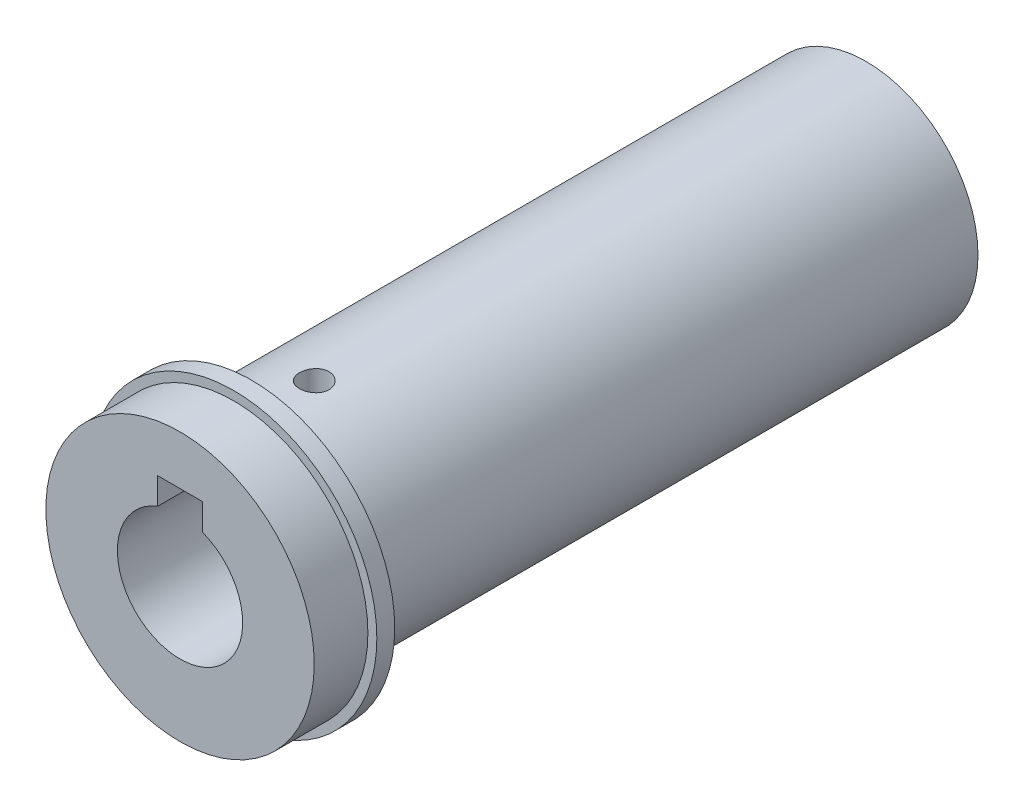
ISO-10303-21;
HEADER;
FILE_DESCRIPTION(('STEP AP214'),'2;1');
FILE_NAME('part.step','',(''),(''),'','','');
FILE_SCHEMA(('AUTOMOTIVE_DESIGN { 1 0 10303 214 1 1 1 1 }'));
ENDSEC;
DATA;
#1=APPLICATION_CONTEXT('core data for automotive mechanical design processes');
#2=APPLICATION_PROTOCOL_DEFINITION('international standard','automotive_design',2000,#1);
#3=PRODUCT_CONTEXT('',#1,'mechanical');
#4=PRODUCT('Part','Part','',(#3));
#5=PRODUCT_RELATED_PRODUCT_CATEGORY('part','',(#4));
#6=PRODUCT_DEFINITION_FORMATION('','',#4);
#7=PRODUCT_DEFINITION_CONTEXT('part definition',#1,'design');
#8=PRODUCT_DEFINITION('design','',#6,#7);
#9=PRODUCT_DEFINITION_SHAPE('','',#8);
#10=(LENGTH_UNIT() NAMED_UNIT(*) SI_UNIT(.MILLI.,.METRE.));
#11=(NAMED_UNIT(*) PLANE_ANGLE_UNIT() SI_UNIT($,.RADIAN.));
#12=(NAMED_UNIT(*) SI_UNIT($,.STERADIAN.) SOLID_ANGLE_UNIT());
#13=UNCERTAINTY_MEASURE_WITH_UNIT(LENGTH_MEASURE(1.E-05),#10,'distance_accuracy_value','');
#14=(GEOMETRIC_REPRESENTATION_CONTEXT(3) GLOBAL_UNCERTAINTY_ASSIGNED_CONTEXT((#13)) GLOBAL_UNIT_ASSIGNED_CONTEXT((#10,
#11,#12)) REPRESENTATION_CONTEXT('',''));
#15=CARTESIAN_POINT('',(0.,0.,0.));
#16=DIRECTION('',(0.,0.,1.));
#17=DIRECTION('',(1.,0.,0.));
#18=AXIS2_PLACEMENT_3D('',#15,#16,#17);
#19=CARTESIAN_POINT('',(0.,0.,68.7));
#20=DIRECTION('',(0.,0.,-1.));
#21=DIRECTION('',(-1.,0.,0.));
#22=AXIS2_PLACEMENT_3D('',#19,#20,#21);
#23=CYLINDRICAL_SURFACE('',#22,12.5);
#24=CARTESIAN_POINT('',(0.,12.5,63.35));
#25=CARTESIAN_POINT('',(-0.0922509659142325,12.4999986553884,63.349996108493));
#26=CARTESIAN_POINT('',(-0.184558502715378,12.498968007311,63.3422373229056));
#27=CARTESIAN_POINT('',(-0.366601950920959,12.4949556982822,63.3114101965439));
#28=CARTESIAN_POINT('',(-0.4563351259759,12.4919720361882,63.2883261525009));
#29=CARTESIAN_POINT('',(-0.630568283941343,12.4843896079466,63.2275430658043));
#30=CARTESIAN_POINT('',(-0.715071856319482,12.4797919643879,63.1898541795178));
#31=CARTESIAN_POINT('',(-0.876539590939077,12.4694920533569,63.1009541850337));
#32=CARTESIAN_POINT('',(-0.95350497870288,12.4637899658902,63.0497452798764));
#33=CARTESIAN_POINT('',(-1.09819718658206,12.4518781663594,62.9349246162499));
#34=CARTESIAN_POINT('',(-1.1658712816474,12.4456658531834,62.8712466789113));
#35=CARTESIAN_POINT('',(-1.28960557413889,12.4334545778039,62.7334377453889));
#36=CARTESIAN_POINT('',(-1.34566516063208,12.4274556268374,62.6593061996809));
#37=CARTESIAN_POINT('',(-1.44477796066646,12.4163248280925,62.5023485063494));
#38=CARTESIAN_POINT('',(-1.48778133107337,12.4111963353939,62.4194906262257));
#39=CARTESIAN_POINT('',(-1.55924262980494,12.4024218004722,62.2476498481938));
#40=CARTESIAN_POINT('',(-1.58770117215908,12.3987756956693,62.1586672090305));
#41=CARTESIAN_POINT('',(-1.62910377910463,12.3934038347284,61.9776521510902));
#42=CARTESIAN_POINT('',(-1.64213723047393,12.3916670186782,61.8856405112843));
#43=CARTESIAN_POINT('',(-1.6525963615546,12.3902766213381,61.7007208517276));
#44=CARTESIAN_POINT('',(-1.65002273886784,12.3906229469364,61.6078128722265));
#45=CARTESIAN_POINT('',(-1.62941406600359,12.3933495814873,61.4243630091398));
#46=CARTESIAN_POINT('',(-1.61147776254764,12.395716899785,61.3338098117739));
#47=CARTESIAN_POINT('',(-1.56080707632498,12.4021985149079,61.1570098424831));
#48=CARTESIAN_POINT('',(-1.52807236230628,12.4063128508388,61.0707631670048));
#49=CARTESIAN_POINT('',(-1.44862884068035,12.4158395520745,60.9047193602968));
#50=CARTESIAN_POINT('',(-1.40187740731702,12.4212558666767,60.8249428591672));
#51=CARTESIAN_POINT('',(-1.29575800474393,12.4327732471151,60.6743301263229));
#52=CARTESIAN_POINT('',(-1.23638939245273,12.4388743478466,60.6034943505989));
#53=CARTESIAN_POINT('',(-1.10617499798151,12.4511315214541,60.4722008987607));
#54=CARTESIAN_POINT('',(-1.03524415653744,12.4572876551224,60.411827556525));
#55=CARTESIAN_POINT('',(-0.884210857811206,12.4689172796715,60.3038303550122));
#56=CARTESIAN_POINT('',(-0.804108375018412,12.4743907686536,60.2562065311987));
#57=CARTESIAN_POINT('',(-0.636938460986377,12.484042355461,60.1750590553997));
#58=CARTESIAN_POINT('',(-0.549868279152667,12.4882199385046,60.1415410048673));
#59=CARTESIAN_POINT('',(-0.371267976474129,12.4948044580827,60.0896251404349));
#60=CARTESIAN_POINT('',(-0.279738088894871,12.4972114871206,60.0712265366073));
#61=CARTESIAN_POINT('',(-0.0955454110605575,12.4999716099048,60.0501818803089));
#62=CARTESIAN_POINT('',(-0.00289610511856397,12.5003398427993,60.047419715491));
#63=CARTESIAN_POINT('',(0.18154414838186,12.4990218465851,60.0574194573786));
#64=CARTESIAN_POINT('',(0.273335116324659,12.4973356663916,60.0701809944688));
#65=CARTESIAN_POINT('',(0.453108088985711,12.4921077115532,60.1107693973755));
#66=CARTESIAN_POINT('',(0.541102881534324,12.4885727966281,60.1385405826276));
#67=CARTESIAN_POINT('',(0.71118657916844,12.4800429260914,60.2083018540169));
#68=CARTESIAN_POINT('',(0.793275262802488,12.4750479157687,60.2502924729797));
#69=CARTESIAN_POINT('',(0.949733027407944,12.4641165128389,60.3475793399222));
#70=CARTESIAN_POINT('',(1.02405527014397,12.4581748993319,60.4029503167502));
#71=CARTESIAN_POINT('',(1.16239311646149,12.4460304374708,60.5253208444056));
#72=CARTESIAN_POINT('',(1.22640826160188,12.4398275775125,60.5923209121987));
#73=CARTESIAN_POINT('',(1.34272949930147,12.4278126689369,60.7365606693967));
#74=CARTESIAN_POINT('',(1.39495839046207,12.422003362126,60.8138628794239));
#75=CARTESIAN_POINT('',(1.48569034045958,12.4114793355964,60.9762107591961));
#76=CARTESIAN_POINT('',(1.52419370073337,12.40676459184,61.0612562588334));
#77=CARTESIAN_POINT('',(1.58625802021031,12.3989825257156,61.2364324575978));
#78=CARTESIAN_POINT('',(1.60986174308102,12.395910492496,61.3265477874228));
#79=CARTESIAN_POINT('',(1.64159408961648,12.3917484325846,61.5095063214484));
#80=CARTESIAN_POINT('',(1.64972352322195,12.390658302158,61.6023493826185));
#81=CARTESIAN_POINT('',(1.65026050729394,12.3905867313463,61.7873595185922));
#82=CARTESIAN_POINT('',(1.64278936343219,12.3915890208826,61.879526258381));
#83=CARTESIAN_POINT('',(1.61259495475241,12.3955542787341,62.0612814162313));
#84=CARTESIAN_POINT('',(1.58987169439037,12.3985172464765,62.1508698350461));
#85=CARTESIAN_POINT('',(1.52985734760343,12.4060648042427,62.3249046327979));
#86=CARTESIAN_POINT('',(1.4925728045936,12.4106486657967,62.4093533017143));
#87=CARTESIAN_POINT('',(1.40450618423475,12.4209226365687,62.5708154653852));
#88=CARTESIAN_POINT('',(1.35372386121887,12.4266127659209,62.6478288247783));
#89=CARTESIAN_POINT('',(1.23965546715594,12.4385110765891,62.7928534458449));
#90=CARTESIAN_POINT('',(1.17627910409951,12.4447228000133,62.8607934040608));
#91=CARTESIAN_POINT('',(1.03901112502639,12.4569335544568,62.9851193500531));
#92=CARTESIAN_POINT('',(0.965117043774374,12.4629325351987,63.0415026214902));
#93=CARTESIAN_POINT('',(0.808549280168606,12.4740702486112,63.1413211149838));
#94=CARTESIAN_POINT('',(0.725839748433097,12.4792052313115,63.1847005022019));
#95=CARTESIAN_POINT('',(0.554286102127632,12.4879988146703,63.2568908306887));
#96=CARTESIAN_POINT('',(0.465448689177239,12.4916589991428,63.28571740896));
#97=CARTESIAN_POINT('',(0.313472456145785,12.4962204250721,63.3211773438647));
#98=CARTESIAN_POINT('',(0.251287086879957,12.4976307637456,63.3319700524388));
#99=CARTESIAN_POINT('',(0.126076615825896,12.4995210067266,63.3463826796329));
#100=CARTESIAN_POINT('',(0.0630515212430898,12.5000009190127,63.3500026597601));
#101=CARTESIAN_POINT('',(0.,12.5,63.35));
#102=B_SPLINE_CURVE_WITH_KNOTS('',3,(#24,#25,#26,#27,#28,#29,#30,#31,#32,#33,#34,#35,#36,#37,
#38,#39,#40,#41,#42,#43,#44,#45,#46,#47,#48,#49,#50,#51,#52,#53,#54,#55,#56,#57,#58,#59,#60,#61,
#62,#63,#64,#65,#66,#67,#68,#69,#70,#71,#72,#73,#74,#75,#76,#77,#78,#79,#80,#81,#82,#83,#84,#85,
#86,#87,#88,#89,#90,#91,#92,#93,#94,#95,#96,#97,#98,#99,#100,#101),.UNSPECIFIED.,.T.,.F.,(4,2,2,
2,2,2,2,2,2,2,2,2,2,2,2,2,2,2,2,2,2,2,2,2,2,2,2,2,2,2,2,2,2,2,2,2,2,2,4),(0.,0.27652256759341,
0.5533289166362,0.829943115961213,1.10651226975201,1.38459116209453,1.66268467791009,
1.94182686179848,2.22095726035026,2.49846208170458,2.77595449929574,3.05167655007196,
3.32740477299745,3.60398015842832,3.88056964393413,4.159294237539,4.43801960642627,
4.71685555395559,4.99567693255306,5.2724251086949,5.5491666956633,5.82488864439133,
6.10062092602062,6.37793027840446,6.65525196160273,6.93434056471003,7.21342303816142,
7.49170082672567,7.76996404953483,8.04607163604136,8.3221791418815,8.59816271557357,
8.87415131265901,9.15219502941573,9.43030402415318,9.70959057439001,9.98857638890452,
10.1775751477029,10.3665722858035),.UNSPECIFIED.);
#103=CARTESIAN_POINT('',(0.,12.5,63.35));
#104=VERTEX_POINT('',#103);
#105=EDGE_CURVE('E214',#104,#104,#102,.T.);
#106=ORIENTED_EDGE('',*,*,#105,.T.);
#107=EDGE_LOOP('',(#106));
#108=FACE_BOUND('',#107,.T.);
#109=DIRECTION('',(0.,0.,-1.));
#110=VECTOR('',#109,1.);
#111=CARTESIAN_POINT('',(3.,-12.1346610995116,68.7));
#112=LINE('',#111,#110);
#113=CARTESIAN_POINT('',(3.,-12.1346610995116,29.7));
#114=VERTEX_POINT('',#113);
#115=CARTESIAN_POINT('',(3.,-12.1346610995116,64.7));
#116=VERTEX_POINT('',#115);
#117=EDGE_CURVE('E202',#114,#116,#112,.F.);
#118=ORIENTED_EDGE('',*,*,#117,.F.);
#119=CARTESIAN_POINT('',(0.,0.,29.7));
#120=DIRECTION('',(0.,0.,-1.));
#121=DIRECTION('',(-1.,0.,0.));
#122=AXIS2_PLACEMENT_3D('',#119,#120,#121);
#123=CIRCLE('',#122,12.5);
#124=CARTESIAN_POINT('',(-3.,-12.1346610995116,29.7));
#125=VERTEX_POINT('',#124);
#126=EDGE_CURVE('E11',#114,#125,#123,.T.);
#127=ORIENTED_EDGE('',*,*,#126,.T.);
#128=DIRECTION('',(0.,0.,-1.));
#129=VECTOR('',#128,1.);
#130=CARTESIAN_POINT('',(-3.,-12.1346610995116,68.7));
#131=LINE('',#130,#129);
#132=CARTESIAN_POINT('',(-3.,-12.1346610995116,64.7));
#133=VERTEX_POINT('',#132);
#134=EDGE_CURVE('E48',#133,#125,#131,.T.);
#135=ORIENTED_EDGE('',*,*,#134,.F.);
#136=CARTESIAN_POINT('',(0.,0.,64.7));
#137=DIRECTION('',(0.,0.,-1.));
#138=DIRECTION('',(-1.,0.,0.));
#139=AXIS2_PLACEMENT_3D('',#136,#137,#138);
#140=CIRCLE('',#139,12.5);
#141=EDGE_CURVE('E184',#116,#133,#140,.T.);
#142=ORIENTED_EDGE('',*,*,#141,.F.);
#143=EDGE_LOOP('',(#118,#127,#135,#142));
#144=FACE_BOUND('',#143,.T.);
#145=CARTESIAN_POINT('',(0.,0.,68.7));
#146=DIRECTION('',(0.,0.,1.));
#147=DIRECTION('',(1.,0.,0.));
#148=AXIS2_PLACEMENT_3D('',#145,#146,#147);
#149=CIRCLE('',#148,12.5);
#150=CARTESIAN_POINT('',(12.5,0.,68.7));
#151=VERTEX_POINT('',#150);
#152=EDGE_CURVE('E185',#151,#151,#149,.T.);
#153=ORIENTED_EDGE('',*,*,#152,.F.);
#154=EDGE_LOOP('',(#153));
#155=FACE_BOUND('',#154,.T.);
#156=CARTESIAN_POINT('',(0.,0.,0.));
#157=DIRECTION('',(0.,0.,1.));
#158=DIRECTION('',(1.,0.,0.));
#159=AXIS2_PLACEMENT_3D('',#156,#157,#158);
#160=CIRCLE('',#159,12.5);
#161=CARTESIAN_POINT('',(12.5,0.,0.));
#162=VERTEX_POINT('',#161);
#163=EDGE_CURVE('E190',#162,#162,#160,.T.);
#164=ORIENTED_EDGE('',*,*,#163,.T.);
#165=EDGE_LOOP('',(#164));
#166=FACE_BOUND('',#165,.T.);
#167=ADVANCED_FACE('F39',(#108,#144,#155,#166),#23,.T.);
#168=CARTESIAN_POINT('',(0.,0.,0.));
#169=DIRECTION('',(0.,0.,1.));
#170=DIRECTION('',(1.,0.,0.));
#171=AXIS2_PLACEMENT_3D('',#168,#169,#170);
#172=PLANE('',#171);
#173=ORIENTED_EDGE('',*,*,#163,.F.);
#174=EDGE_LOOP('',(#173));
#175=FACE_BOUND('',#174,.T.);
#176=ADVANCED_FACE('F282',(#175),#172,.F.);
#177=CARTESIAN_POINT('',(0.,0.,70.7));
#178=DIRECTION('',(0.,0.,-1.));
#179=DIRECTION('',(-1.,0.,0.));
#180=AXIS2_PLACEMENT_3D('',#177,#178,#179);
#181=CYLINDRICAL_SURFACE('',#180,16.);
#182=CARTESIAN_POINT('',(0.,0.,70.7));
#183=DIRECTION('',(0.,0.,1.));
#184=DIRECTION('',(1.,0.,0.));
#185=AXIS2_PLACEMENT_3D('',#182,#183,#184);
#186=CIRCLE('',#185,16.);
#187=CARTESIAN_POINT('',(16.,0.,70.7));
#188=VERTEX_POINT('',#187);
#189=EDGE_CURVE('E186',#188,#188,#186,.T.);
#190=ORIENTED_EDGE('',*,*,#189,.F.);
#191=EDGE_LOOP('',(#190));
#192=FACE_BOUND('',#191,.T.);
#193=CARTESIAN_POINT('',(0.,0.,68.7));
#194=DIRECTION('',(0.,0.,1.));
#195=DIRECTION('',(1.,0.,0.));
#196=AXIS2_PLACEMENT_3D('',#193,#194,#195);
#197=CIRCLE('',#196,16.);
#198=CARTESIAN_POINT('',(16.,0.,68.7));
#199=VERTEX_POINT('',#198);
#200=EDGE_CURVE('E179',#199,#199,#197,.T.);
#201=ORIENTED_EDGE('',*,*,#200,.T.);
#202=EDGE_LOOP('',(#201));
#203=FACE_BOUND('',#202,.T.);
#204=ADVANCED_FACE('F276',(#192,#203),#181,.T.);
#205=CARTESIAN_POINT('',(0.,0.,70.7));
#206=DIRECTION('',(0.,0.,1.));
#207=DIRECTION('',(1.,0.,0.));
#208=AXIS2_PLACEMENT_3D('',#205,#206,#207);
#209=PLANE('',#208);
#210=CARTESIAN_POINT('',(0.,0.,70.7));
#211=DIRECTION('',(0.,0.,1.));
#212=DIRECTION('',(1.,0.,0.));
#213=AXIS2_PLACEMENT_3D('',#210,#211,#212);
#214=CIRCLE('',#213,15.);
#215=CARTESIAN_POINT('',(15.,0.,70.7));
#216=VERTEX_POINT('',#215);
#217=EDGE_CURVE('E180',#216,#216,#214,.T.);
#218=ORIENTED_EDGE('',*,*,#217,.F.);
#219=EDGE_LOOP('',(#218));
#220=FACE_BOUND('',#219,.T.);
#221=ORIENTED_EDGE('',*,*,#189,.T.);
#222=EDGE_LOOP('',(#221));
#223=FACE_BOUND('',#222,.T.);
#224=ADVANCED_FACE('F273',(#220,#223),#209,.T.);
#225=CARTESIAN_POINT('',(0.,0.,68.7));
#226=DIRECTION('',(0.,0.,1.));
#227=DIRECTION('',(1.,0.,0.));
#228=AXIS2_PLACEMENT_3D('',#225,#226,#227);
#229=PLANE('',#228);
#230=ORIENTED_EDGE('',*,*,#152,.T.);
#231=EDGE_LOOP('',(#230));
#232=FACE_BOUND('',#231,.T.);
#233=ORIENTED_EDGE('',*,*,#200,.F.);
#234=EDGE_LOOP('',(#233));
#235=FACE_BOUND('',#234,.T.);
#236=ADVANCED_FACE('F271',(#232,#235),#229,.F.);
#237=CARTESIAN_POINT('',(0.,0.,76.7));
#238=DIRECTION('',(0.,0.,-1.));
#239=DIRECTION('',(-1.,0.,0.));
#240=AXIS2_PLACEMENT_3D('',#237,#238,#239);
#241=CYLINDRICAL_SURFACE('',#240,15.);
#242=CARTESIAN_POINT('',(0.,0.,76.7));
#243=DIRECTION('',(0.,0.,1.));
#244=DIRECTION('',(1.,0.,0.));
#245=AXIS2_PLACEMENT_3D('',#242,#243,#244);
#246=CIRCLE('',#245,15.);
#247=CARTESIAN_POINT('',(15.,0.,76.7));
#248=VERTEX_POINT('',#247);
#249=EDGE_CURVE('E167',#248,#248,#246,.T.);
#250=ORIENTED_EDGE('',*,*,#249,.F.);
#251=EDGE_LOOP('',(#250));
#252=FACE_BOUND('',#251,.T.);
#253=ORIENTED_EDGE('',*,*,#217,.T.);
#254=EDGE_LOOP('',(#253));
#255=FACE_BOUND('',#254,.T.);
#256=ADVANCED_FACE('F267',(#252,#255),#241,.T.);
#257=CARTESIAN_POINT('',(0.,0.,76.7));
#258=DIRECTION('',(0.,0.,1.));
#259=DIRECTION('',(1.,0.,0.));
#260=AXIS2_PLACEMENT_3D('',#257,#258,#259);
#261=PLANE('',#260);
#262=CARTESIAN_POINT('',(0.,0.,76.7));
#263=DIRECTION('',(0.,0.,1.));
#264=DIRECTION('',(1.,0.,0.));
#265=AXIS2_PLACEMENT_3D('',#262,#263,#264);
#266=CIRCLE('',#265,7.);
#267=CARTESIAN_POINT('',(-2.5,6.53834841531101,76.7));
#268=VERTEX_POINT('',#267);
#269=CARTESIAN_POINT('',(2.5,6.53834841531101,76.7));
#270=VERTEX_POINT('',#269);
#271=EDGE_CURVE('E63',#268,#270,#266,.T.);
#272=ORIENTED_EDGE('',*,*,#271,.F.);
#273=DIRECTION('',(0.,1.,0.));
#274=VECTOR('',#273,1.);
#275=CARTESIAN_POINT('',(-2.5,0.,76.7));
#276=LINE('',#275,#274);
#277=CARTESIAN_POINT('',(-2.5,9.5,76.7));
#278=VERTEX_POINT('',#277);
#279=EDGE_CURVE('E143',#268,#278,#276,.T.);
#280=ORIENTED_EDGE('',*,*,#279,.T.);
#281=DIRECTION('',(1.,0.,0.));
#282=VECTOR('',#281,1.);
#283=CARTESIAN_POINT('',(0.,9.5,76.7));
#284=LINE('',#283,#282);
#285=CARTESIAN_POINT('',(2.5,9.5,76.7));
#286=VERTEX_POINT('',#285);
#287=EDGE_CURVE('E157',#278,#286,#284,.T.);
#288=ORIENTED_EDGE('',*,*,#287,.T.);
#289=DIRECTION('',(0.,1.,0.));
#290=VECTOR('',#289,1.);
#291=CARTESIAN_POINT('',(2.5,0.,76.7));
#292=LINE('',#291,#290);
#293=EDGE_CURVE('E133',#270,#286,#292,.T.);
#294=ORIENTED_EDGE('',*,*,#293,.F.);
#295=EDGE_LOOP('',(#272,#280,#288,#294));
#296=FACE_BOUND('',#295,.T.);
#297=ORIENTED_EDGE('',*,*,#249,.T.);
#298=EDGE_LOOP('',(#297));
#299=FACE_BOUND('',#298,.T.);
#300=ADVANCED_FACE('F264',(#296,#299),#261,.T.);
#301=CARTESIAN_POINT('',(0.,0.,46.7));
#302=DIRECTION('',(0.,0.,1.));
#303=DIRECTION('',(1.,0.,0.));
#304=AXIS2_PLACEMENT_3D('',#301,#302,#303);
#305=CYLINDRICAL_SURFACE('',#304,7.);
#306=ORIENTED_EDGE('',*,*,#271,.T.);
#307=DIRECTION('',(0.,0.,1.));
#308=VECTOR('',#307,1.);
#309=CARTESIAN_POINT('',(2.5,6.53834841531101,46.7));
#310=LINE('',#309,#308);
#311=CARTESIAN_POINT('',(2.5,6.53834841531101,46.7));
#312=VERTEX_POINT('',#311);
#313=EDGE_CURVE('E152',#312,#270,#310,.T.);
#314=ORIENTED_EDGE('',*,*,#313,.F.);
#315=CARTESIAN_POINT('',(0.,0.,46.7));
#316=DIRECTION('',(0.,0.,1.));
#317=DIRECTION('',(1.,0.,0.));
#318=AXIS2_PLACEMENT_3D('',#315,#316,#317);
#319=CIRCLE('',#318,7.);
#320=CARTESIAN_POINT('',(-2.5,6.53834841531101,46.7));
#321=VERTEX_POINT('',#320);
#322=EDGE_CURVE('E138',#321,#312,#319,.T.);
#323=ORIENTED_EDGE('',*,*,#322,.F.);
#324=DIRECTION('',(0.,0.,1.));
#325=VECTOR('',#324,1.);
#326=CARTESIAN_POINT('',(-2.5,6.53834841531101,46.7));
#327=LINE('',#326,#325);
#328=EDGE_CURVE('E164',#321,#268,#327,.T.);
#329=ORIENTED_EDGE('',*,*,#328,.T.);
#330=EDGE_LOOP('',(#306,#314,#323,#329));
#331=FACE_BOUND('',#330,.T.);
#332=ADVANCED_FACE('F254',(#331),#305,.F.);
#333=CARTESIAN_POINT('',(-2.5,0.,46.7));
#334=DIRECTION('',(1.,0.,0.));
#335=DIRECTION('',(0.,0.,-1.));
#336=AXIS2_PLACEMENT_3D('',#333,#334,#335);
#337=PLANE('',#336);
#338=ORIENTED_EDGE('',*,*,#279,.F.);
#339=ORIENTED_EDGE('',*,*,#328,.F.);
#340=DIRECTION('',(0.,1.,0.));
#341=VECTOR('',#340,1.);
#342=CARTESIAN_POINT('',(-2.5,0.,46.7));
#343=LINE('',#342,#341);
#344=CARTESIAN_POINT('',(-2.5,9.5,46.7));
#345=VERTEX_POINT('',#344);
#346=EDGE_CURVE('E150',#321,#345,#343,.T.);
#347=ORIENTED_EDGE('',*,*,#346,.T.);
#348=DIRECTION('',(0.,0.,1.));
#349=VECTOR('',#348,1.);
#350=CARTESIAN_POINT('',(-2.5,9.5,46.7));
#351=LINE('',#350,#349);
#352=EDGE_CURVE('E168',#345,#278,#351,.T.);
#353=ORIENTED_EDGE('',*,*,#352,.T.);
#354=EDGE_LOOP('',(#338,#339,#347,#353));
#355=FACE_BOUND('',#354,.T.);
#356=ADVANCED_FACE('F250',(#355),#337,.T.);
#357=CARTESIAN_POINT('',(0.,9.5,46.7));
#358=DIRECTION('',(0.,-1.,0.));
#359=DIRECTION('',(0.,0.,-1.));
#360=AXIS2_PLACEMENT_3D('',#357,#358,#359);
#361=PLANE('',#360);
#362=CARTESIAN_POINT('',(0.,9.5,61.7));
#363=DIRECTION('',(0.,-1.,0.));
#364=DIRECTION('',(0.,0.,-1.));
#365=AXIS2_PLACEMENT_3D('',#362,#363,#364);
#366=CIRCLE('',#365,1.65);
#367=CARTESIAN_POINT('',(0.,9.5,60.05));
#368=VERTEX_POINT('',#367);
#369=EDGE_CURVE('E220',#368,#368,#366,.T.);
#370=ORIENTED_EDGE('',*,*,#369,.F.);
#371=EDGE_LOOP('',(#370));
#372=FACE_BOUND('',#371,.T.);
#373=ORIENTED_EDGE('',*,*,#287,.F.);
#374=ORIENTED_EDGE('',*,*,#352,.F.);
#375=DIRECTION('',(1.,0.,0.));
#376=VECTOR('',#375,1.);
#377=CARTESIAN_POINT('',(0.,9.5,46.7));
#378=LINE('',#377,#376);
#379=CARTESIAN_POINT('',(2.5,9.5,46.7));
#380=VERTEX_POINT('',#379);
#381=EDGE_CURVE('E147',#345,#380,#378,.T.);
#382=ORIENTED_EDGE('',*,*,#381,.T.);
#383=DIRECTION('',(0.,0.,1.));
#384=VECTOR('',#383,1.);
#385=CARTESIAN_POINT('',(2.5,9.5,46.7));
#386=LINE('',#385,#384);
#387=EDGE_CURVE('E171',#380,#286,#386,.T.);
#388=ORIENTED_EDGE('',*,*,#387,.T.);
#389=EDGE_LOOP('',(#373,#374,#382,#388));
#390=FACE_BOUND('',#389,.T.);
#391=ADVANCED_FACE('F253',(#372,#390),#361,.T.);
#392=CARTESIAN_POINT('',(2.5,0.,46.7));
#393=DIRECTION('',(1.,0.,0.));
#394=DIRECTION('',(0.,0.,-1.));
#395=AXIS2_PLACEMENT_3D('',#392,#393,#394);
#396=PLANE('',#395);
#397=ORIENTED_EDGE('',*,*,#293,.T.);
#398=ORIENTED_EDGE('',*,*,#387,.F.);
#399=DIRECTION('',(0.,1.,0.));
#400=VECTOR('',#399,1.);
#401=CARTESIAN_POINT('',(2.5,0.,46.7));
#402=LINE('',#401,#400);
#403=EDGE_CURVE('E142',#312,#380,#402,.T.);
#404=ORIENTED_EDGE('',*,*,#403,.F.);
#405=ORIENTED_EDGE('',*,*,#313,.T.);
#406=EDGE_LOOP('',(#397,#398,#404,#405));
#407=FACE_BOUND('',#406,.T.);
#408=ADVANCED_FACE('F248',(#407),#396,.F.);
#409=CARTESIAN_POINT('',(0.,0.,46.7));
#410=DIRECTION('',(0.,0.,1.));
#411=DIRECTION('',(1.,0.,0.));
#412=AXIS2_PLACEMENT_3D('',#409,#410,#411);
#413=PLANE('',#412);
#414=ORIENTED_EDGE('',*,*,#322,.T.);
#415=ORIENTED_EDGE('',*,*,#403,.T.);
#416=ORIENTED_EDGE('',*,*,#381,.F.);
#417=ORIENTED_EDGE('',*,*,#346,.F.);
#418=EDGE_LOOP('',(#414,#415,#416,#417));
#419=FACE_BOUND('',#418,.T.);
#420=ADVANCED_FACE('F245',(#419),#413,.T.);
#421=CARTESIAN_POINT('',(-3.,-9.5,29.7));
#422=DIRECTION('',(1.,0.,0.));
#423=DIRECTION('',(0.,1.,0.));
#424=AXIS2_PLACEMENT_3D('',#421,#422,#423);
#425=PLANE('',#424);
#426=ORIENTED_EDGE('',*,*,#134,.T.);
#427=DIRECTION('',(0.,1.,0.));
#428=VECTOR('',#427,1.);
#429=CARTESIAN_POINT('',(-3.,-9.5,29.7));
#430=LINE('',#429,#428);
#431=CARTESIAN_POINT('',(-3.,-9.5,29.7));
#432=VERTEX_POINT('',#431);
#433=EDGE_CURVE('E105',#125,#432,#430,.T.);
#434=ORIENTED_EDGE('',*,*,#433,.T.);
#435=DIRECTION('',(0.,0.,1.));
#436=VECTOR('',#435,1.);
#437=CARTESIAN_POINT('',(-3.,-9.5,29.7));
#438=LINE('',#437,#436);
#439=CARTESIAN_POINT('',(-3.,-9.5,64.7));
#440=VERTEX_POINT('',#439);
#441=EDGE_CURVE('E110',#432,#440,#438,.T.);
#442=ORIENTED_EDGE('',*,*,#441,.T.);
#443=DIRECTION('',(0.,1.,0.));
#444=VECTOR('',#443,1.);
#445=CARTESIAN_POINT('',(-3.,-9.5,64.7));
#446=LINE('',#445,#444);
#447=EDGE_CURVE('E212',#133,#440,#446,.T.);
#448=ORIENTED_EDGE('',*,*,#447,.F.);
#449=EDGE_LOOP('',(#426,#434,#442,#448));
#450=FACE_BOUND('',#449,.T.);
#451=ADVANCED_FACE('F107',(#450),#425,.T.);
#452=CARTESIAN_POINT('',(3.,-9.5,29.7));
#453=DIRECTION('',(-1.,0.,0.));
#454=DIRECTION('',(0.,-1.,0.));
#455=AXIS2_PLACEMENT_3D('',#452,#453,#454);
#456=PLANE('',#455);
#457=ORIENTED_EDGE('',*,*,#117,.T.);
#458=DIRECTION('',(0.,-1.,0.));
#459=VECTOR('',#458,1.);
#460=CARTESIAN_POINT('',(3.,-9.5,64.7));
#461=LINE('',#460,#459);
#462=CARTESIAN_POINT('',(3.,-9.5,64.7));
#463=VERTEX_POINT('',#462);
#464=EDGE_CURVE('E55',#463,#116,#461,.T.);
#465=ORIENTED_EDGE('',*,*,#464,.F.);
#466=DIRECTION('',(0.,0.,1.));
#467=VECTOR('',#466,1.);
#468=CARTESIAN_POINT('',(3.,-9.5,29.7));
#469=LINE('',#468,#467);
#470=CARTESIAN_POINT('',(3.,-9.5,29.7));
#471=VERTEX_POINT('',#470);
#472=EDGE_CURVE('E129',#471,#463,#469,.T.);
#473=ORIENTED_EDGE('',*,*,#472,.F.);
#474=DIRECTION('',(0.,-1.,0.));
#475=VECTOR('',#474,1.);
#476=CARTESIAN_POINT('',(3.,-9.5,29.7));
#477=LINE('',#476,#475);
#478=EDGE_CURVE('E119',#471,#114,#477,.T.);
#479=ORIENTED_EDGE('',*,*,#478,.T.);
#480=EDGE_LOOP('',(#457,#465,#473,#479));
#481=FACE_BOUND('',#480,.T.);
#482=ADVANCED_FACE('F208',(#481),#456,.T.);
#483=CARTESIAN_POINT('',(0.,0.,29.7));
#484=DIRECTION('',(0.,0.,-1.));
#485=DIRECTION('',(-1.,0.,0.));
#486=AXIS2_PLACEMENT_3D('',#483,#484,#485);
#487=PLANE('',#486);
#488=ORIENTED_EDGE('',*,*,#478,.F.);
#489=DIRECTION('',(1.,0.,0.));
#490=VECTOR('',#489,1.);
#491=CARTESIAN_POINT('',(3.,-9.5,29.7));
#492=LINE('',#491,#490);
#493=EDGE_CURVE('E114',#432,#471,#492,.T.);
#494=ORIENTED_EDGE('',*,*,#493,.F.);
#495=ORIENTED_EDGE('',*,*,#433,.F.);
#496=ORIENTED_EDGE('',*,*,#126,.F.);
#497=EDGE_LOOP('',(#488,#494,#495,#496));
#498=FACE_BOUND('',#497,.T.);
#499=ADVANCED_FACE('F117',(#498),#487,.F.);
#500=CARTESIAN_POINT('',(0.,0.,64.7));
#501=DIRECTION('',(0.,0.,-1.));
#502=DIRECTION('',(-1.,0.,0.));
#503=AXIS2_PLACEMENT_3D('',#500,#501,#502);
#504=PLANE('',#503);
#505=ORIENTED_EDGE('',*,*,#141,.T.);
#506=ORIENTED_EDGE('',*,*,#447,.T.);
#507=DIRECTION('',(1.,0.,0.));
#508=VECTOR('',#507,1.);
#509=CARTESIAN_POINT('',(3.,-9.5,64.7));
#510=LINE('',#509,#508);
#511=EDGE_CURVE('E127',#440,#463,#510,.T.);
#512=ORIENTED_EDGE('',*,*,#511,.T.);
#513=ORIENTED_EDGE('',*,*,#464,.T.);
#514=EDGE_LOOP('',(#505,#506,#512,#513));
#515=FACE_BOUND('',#514,.T.);
#516=ADVANCED_FACE('F211',(#515),#504,.T.);
#517=CARTESIAN_POINT('',(3.,-9.5,29.7));
#518=DIRECTION('',(0.,-1.,0.));
#519=DIRECTION('',(0.,0.,-1.));
#520=AXIS2_PLACEMENT_3D('',#517,#518,#519);
#521=PLANE('',#520);
#522=ORIENTED_EDGE('',*,*,#511,.F.);
#523=ORIENTED_EDGE('',*,*,#441,.F.);
#524=ORIENTED_EDGE('',*,*,#493,.T.);
#525=ORIENTED_EDGE('',*,*,#472,.T.);
#526=EDGE_LOOP('',(#522,#523,#524,#525));
#527=FACE_BOUND('',#526,.T.);
#528=ADVANCED_FACE('F126',(#527),#521,.T.);
#529=CARTESIAN_POINT('',(0.,12.5,61.7));
#530=DIRECTION('',(0.,1.,0.));
#531=DIRECTION('',(0.,0.,1.));
#532=AXIS2_PLACEMENT_3D('',#529,#530,#531);
#533=CYLINDRICAL_SURFACE('',#532,1.65);
#534=ORIENTED_EDGE('',*,*,#369,.T.);
#535=EDGE_LOOP('',(#534));
#536=FACE_BOUND('',#535,.T.);
#537=ORIENTED_EDGE('',*,*,#105,.F.);
#538=EDGE_LOOP('',(#537));
#539=FACE_BOUND('',#538,.T.);
#540=ADVANCED_FACE('F230',(#536,#539),#533,.F.);
#541=CLOSED_SHELL('',(#167,#176,#204,#224,#236,#256,#300,#332,#356,#391,#408,#420,#451,#482,
#499,#516,#528,#540));
#542=MANIFOLD_SOLID_BREP('B2',#541);
#543=ADVANCED_BREP_SHAPE_REPRESENTATION('',(#18,#542),#14);
#544=SHAPE_DEFINITION_REPRESENTATION(#9,#543);
ENDSEC;
END-ISO-10303-21;
